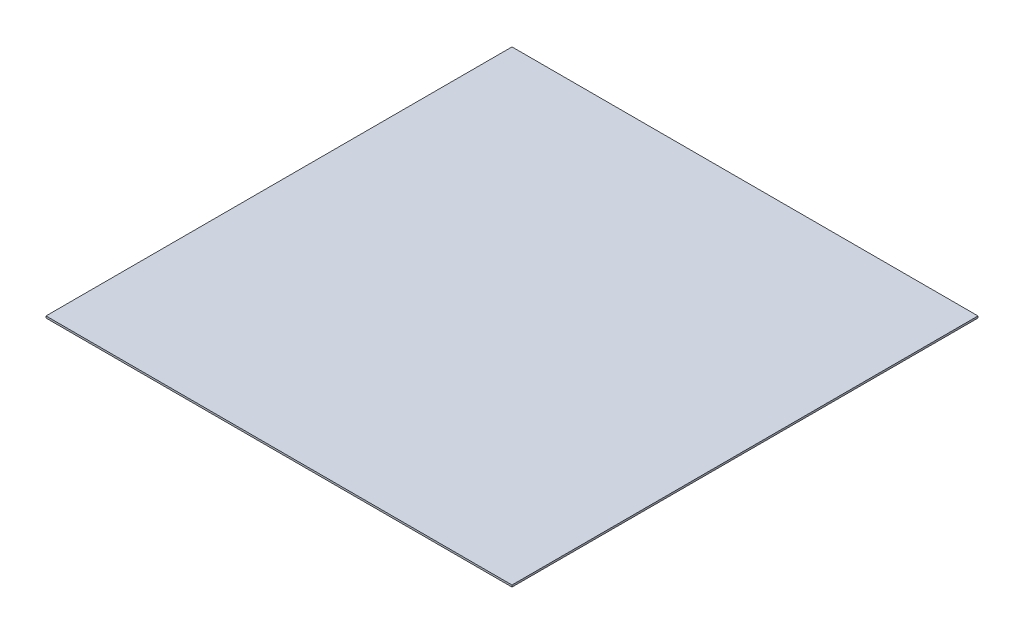
ISO-10303-21;
HEADER;
FILE_DESCRIPTION(('STEP AP214'),'2;1');
FILE_NAME('part.step','',(''),(''),'','','');
FILE_SCHEMA(('AUTOMOTIVE_DESIGN { 1 0 10303 214 1 1 1 1 }'));
ENDSEC;
DATA;
#1=APPLICATION_CONTEXT('core data for automotive mechanical design processes');
#2=APPLICATION_PROTOCOL_DEFINITION('international standard','automotive_design',2000,#1);
#3=PRODUCT_CONTEXT('',#1,'mechanical');
#4=PRODUCT('Part','Part','',(#3));
#5=PRODUCT_RELATED_PRODUCT_CATEGORY('part','',(#4));
#6=PRODUCT_DEFINITION_FORMATION('','',#4);
#7=PRODUCT_DEFINITION_CONTEXT('part definition',#1,'design');
#8=PRODUCT_DEFINITION('design','',#6,#7);
#9=PRODUCT_DEFINITION_SHAPE('','',#8);
#10=(LENGTH_UNIT() NAMED_UNIT(*) SI_UNIT(.MILLI.,.METRE.));
#11=(NAMED_UNIT(*) PLANE_ANGLE_UNIT() SI_UNIT($,.RADIAN.));
#12=(NAMED_UNIT(*) SI_UNIT($,.STERADIAN.) SOLID_ANGLE_UNIT());
#13=UNCERTAINTY_MEASURE_WITH_UNIT(LENGTH_MEASURE(1.E-05),#10,'distance_accuracy_value','');
#14=(GEOMETRIC_REPRESENTATION_CONTEXT(3) GLOBAL_UNCERTAINTY_ASSIGNED_CONTEXT((#13)) GLOBAL_UNIT_ASSIGNED_CONTEXT((#10,
#11,#12)) REPRESENTATION_CONTEXT('',''));
#15=CARTESIAN_POINT('',(0.,0.,0.));
#16=DIRECTION('',(0.,0.,1.));
#17=DIRECTION('',(1.,0.,0.));
#18=AXIS2_PLACEMENT_3D('',#15,#16,#17);
#19=CARTESIAN_POINT('',(103.,10.,-10.));
#20=DIRECTION('',(0.,0.,1.));
#21=DIRECTION('',(1.,0.,0.));
#22=AXIS2_PLACEMENT_3D('',#19,#20,#21);
#23=PLANE('',#22);
#24=CARTESIAN_POINT('',(0.,55.,-10.));
#25=DIRECTION('',(0.,0.,1.));
#26=DIRECTION('',(1.,0.,0.));
#27=AXIS2_PLACEMENT_3D('',#24,#25,#26);
#28=CIRCLE('',#27,15.);
#29=CARTESIAN_POINT('',(-14.1421356237309,60.,-10.));
#30=VERTEX_POINT('',#29);
#31=CARTESIAN_POINT('',(-13.467179647447,48.3943151495557,-10.));
#32=VERTEX_POINT('',#31);
#33=EDGE_CURVE('E11',#30,#32,#28,.T.);
#34=ORIENTED_EDGE('',*,*,#33,.F.);
#35=DIRECTION('',(-1.,0.,0.));
#36=VECTOR('',#35,1.);
#37=CARTESIAN_POINT('',(103.,60.,-10.));
#38=LINE('',#37,#36);
#39=CARTESIAN_POINT('',(-20.,60.,-10.));
#40=VERTEX_POINT('',#39);
#41=EDGE_CURVE('E264',#30,#40,#38,.T.);
#42=ORIENTED_EDGE('',*,*,#41,.T.);
#43=DIRECTION('',(-0.330350424728106,-0.943858356366018,0.));
#44=VECTOR('',#43,1.);
#45=CARTESIAN_POINT('',(-20.,60.,-10.));
#46=LINE('',#45,#44);
#47=CARTESIAN_POINT('',(-37.5,10.,-10.));
#48=VERTEX_POINT('',#47);
#49=EDGE_CURVE('E298',#40,#48,#46,.T.);
#50=ORIENTED_EDGE('',*,*,#49,.T.);
#51=DIRECTION('',(-1.,0.,0.));
#52=VECTOR('',#51,1.);
#53=CARTESIAN_POINT('',(103.,10.,-10.));
#54=LINE('',#53,#52);
#55=CARTESIAN_POINT('',(-26.9051899497914,10.,-10.));
#56=VERTEX_POINT('',#55);
#57=EDGE_CURVE('E267',#56,#48,#54,.T.);
#58=ORIENTED_EDGE('',*,*,#57,.F.);
#59=DIRECTION('',(0.330350424728106,0.943858356366017,0.));
#60=VECTOR('',#59,1.);
#61=CARTESIAN_POINT('',(-12.9051899497914,50.,-10.));
#62=LINE('',#61,#60);
#63=EDGE_CURVE('E287',#56,#32,#62,.T.);
#64=ORIENTED_EDGE('',*,*,#63,.T.);
#65=EDGE_LOOP('',(#34,#42,#50,#58,#64));
#66=FACE_BOUND('',#65,.T.);
#67=ADVANCED_FACE('F17',(#66),#23,.T.);
#68=CARTESIAN_POINT('',(103.,10.,10.));
#69=DIRECTION('',(0.,0.,-1.));
#70=DIRECTION('',(-1.,0.,0.));
#71=AXIS2_PLACEMENT_3D('',#68,#69,#70);
#72=PLANE('',#71);
#73=CARTESIAN_POINT('',(0.,55.,10.));
#74=DIRECTION('',(0.,0.,-1.));
#75=DIRECTION('',(-1.,0.,0.));
#76=AXIS2_PLACEMENT_3D('',#73,#74,#75);
#77=CIRCLE('',#76,15.);
#78=CARTESIAN_POINT('',(14.1421356237309,60.,10.));
#79=VERTEX_POINT('',#78);
#80=CARTESIAN_POINT('',(13.467179647447,48.3943151495557,10.));
#81=VERTEX_POINT('',#80);
#82=EDGE_CURVE('E205',#79,#81,#77,.T.);
#83=ORIENTED_EDGE('',*,*,#82,.F.);
#84=DIRECTION('',(-1.,0.,0.));
#85=VECTOR('',#84,1.);
#86=CARTESIAN_POINT('',(103.,60.,10.));
#87=LINE('',#86,#85);
#88=CARTESIAN_POINT('',(20.,60.,10.));
#89=VERTEX_POINT('',#88);
#90=EDGE_CURVE('E183',#89,#79,#87,.T.);
#91=ORIENTED_EDGE('',*,*,#90,.F.);
#92=DIRECTION('',(0.330350424728106,-0.943858356366018,0.));
#93=VECTOR('',#92,1.);
#94=CARTESIAN_POINT('',(20.,60.,10.));
#95=LINE('',#94,#93);
#96=CARTESIAN_POINT('',(37.5,10.,10.));
#97=VERTEX_POINT('',#96);
#98=EDGE_CURVE('E283',#89,#97,#95,.T.);
#99=ORIENTED_EDGE('',*,*,#98,.T.);
#100=DIRECTION('',(-1.,0.,0.));
#101=VECTOR('',#100,1.);
#102=CARTESIAN_POINT('',(103.,10.,10.));
#103=LINE('',#102,#101);
#104=CARTESIAN_POINT('',(26.9051899497914,10.,10.));
#105=VERTEX_POINT('',#104);
#106=EDGE_CURVE('E196',#97,#105,#103,.T.);
#107=ORIENTED_EDGE('',*,*,#106,.T.);
#108=DIRECTION('',(-0.330350424728106,0.943858356366018,0.));
#109=VECTOR('',#108,1.);
#110=CARTESIAN_POINT('',(12.9051899497914,50.,10.));
#111=LINE('',#110,#109);
#112=EDGE_CURVE('E280',#105,#81,#111,.T.);
#113=ORIENTED_EDGE('',*,*,#112,.T.);
#114=EDGE_LOOP('',(#83,#91,#99,#107,#113));
#115=FACE_BOUND('',#114,.T.);
#116=ADVANCED_FACE('F451',(#115),#72,.T.);
#117=CARTESIAN_POINT('',(0.,60.,0.));
#118=DIRECTION('',(0.,1.,0.));
#119=DIRECTION('',(0.,0.,1.));
#120=AXIS2_PLACEMENT_3D('',#117,#118,#119);
#121=PLANE('',#120);
#122=DIRECTION('',(0.,0.,-1.));
#123=VECTOR('',#122,1.);
#124=CARTESIAN_POINT('',(-20.,60.,0.));
#125=LINE('',#124,#123);
#126=CARTESIAN_POINT('',(-20.,60.,-20.));
#127=VERTEX_POINT('',#126);
#128=EDGE_CURVE('E376',#40,#127,#125,.T.);
#129=ORIENTED_EDGE('',*,*,#128,.F.);
#130=ORIENTED_EDGE('',*,*,#41,.F.);
#131=CARTESIAN_POINT('',(14.1421356237309,60.,-10.));
#132=VERTEX_POINT('',#131);
#133=EDGE_CURVE('E268',#132,#30,#38,.T.);
#134=ORIENTED_EDGE('',*,*,#133,.F.);
#135=CARTESIAN_POINT('',(20.,60.,-10.));
#136=VERTEX_POINT('',#135);
#137=EDGE_CURVE('E265',#136,#132,#38,.T.);
#138=ORIENTED_EDGE('',*,*,#137,.F.);
#139=DIRECTION('',(0.,0.,1.));
#140=VECTOR('',#139,1.);
#141=CARTESIAN_POINT('',(20.,60.,0.));
#142=LINE('',#141,#140);
#143=CARTESIAN_POINT('',(20.,60.,-20.));
#144=VERTEX_POINT('',#143);
#145=EDGE_CURVE('E380',#144,#136,#142,.T.);
#146=ORIENTED_EDGE('',*,*,#145,.F.);
#147=DIRECTION('',(-1.,0.,0.));
#148=VECTOR('',#147,1.);
#149=CARTESIAN_POINT('',(103.,60.,-20.));
#150=LINE('',#149,#148);
#151=EDGE_CURVE('E300',#144,#127,#150,.T.);
#152=ORIENTED_EDGE('',*,*,#151,.T.);
#153=EDGE_LOOP('',(#129,#130,#134,#138,#146,#152));
#154=FACE_BOUND('',#153,.T.);
#155=ADVANCED_FACE('F458',(#154),#121,.T.);
#156=CARTESIAN_POINT('',(20.,60.,20.));
#157=VERTEX_POINT('',#156);
#158=EDGE_CURVE('E379',#89,#157,#142,.T.);
#159=ORIENTED_EDGE('',*,*,#158,.F.);
#160=ORIENTED_EDGE('',*,*,#90,.T.);
#161=CARTESIAN_POINT('',(-14.1421356237309,60.,10.));
#162=VERTEX_POINT('',#161);
#163=EDGE_CURVE('E176',#79,#162,#87,.T.);
#164=ORIENTED_EDGE('',*,*,#163,.T.);
#165=CARTESIAN_POINT('',(-20.,60.,10.));
#166=VERTEX_POINT('',#165);
#167=EDGE_CURVE('E181',#162,#166,#87,.T.);
#168=ORIENTED_EDGE('',*,*,#167,.T.);
#169=CARTESIAN_POINT('',(-20.,60.,20.));
#170=VERTEX_POINT('',#169);
#171=EDGE_CURVE('E377',#170,#166,#125,.T.);
#172=ORIENTED_EDGE('',*,*,#171,.F.);
#173=DIRECTION('',(-1.,0.,0.));
#174=VECTOR('',#173,1.);
#175=CARTESIAN_POINT('',(103.,60.,20.));
#176=LINE('',#175,#174);
#177=EDGE_CURVE('E303',#157,#170,#176,.T.);
#178=ORIENTED_EDGE('',*,*,#177,.F.);
#179=EDGE_LOOP('',(#159,#160,#164,#168,#172,#178));
#180=FACE_BOUND('',#179,.T.);
#181=ADVANCED_FACE('F179',(#180),#121,.T.);
#182=CARTESIAN_POINT('',(-20.,60.,-65.5));
#183=DIRECTION('',(0.943858356366017,-0.330350424728106,0.));
#184=DIRECTION('',(0.330350424728106,0.943858356366018,0.));
#185=AXIS2_PLACEMENT_3D('',#182,#183,#184);
#186=PLANE('',#185);
#187=ORIENTED_EDGE('',*,*,#49,.F.);
#188=ORIENTED_EDGE('',*,*,#128,.T.);
#189=DIRECTION('',(0.313677500463754,0.896221429896442,0.313677500463755));
#190=VECTOR('',#189,1.);
#191=CARTESIAN_POINT('',(-24.4769076305221,47.2088353413655,-24.4769076305221));
#192=LINE('',#191,#190);
#193=CARTESIAN_POINT('',(-37.5,10.,-37.5));
#194=VERTEX_POINT('',#193);
#195=EDGE_CURVE('E312',#194,#127,#192,.T.);
#196=ORIENTED_EDGE('',*,*,#195,.F.);
#197=DIRECTION('',(0.,0.,1.));
#198=VECTOR('',#197,1.);
#199=CARTESIAN_POINT('',(-37.5,10.,37.5));
#200=LINE('',#199,#198);
#201=EDGE_CURVE('E344',#194,#48,#200,.T.);
#202=ORIENTED_EDGE('',*,*,#201,.T.);
#203=EDGE_LOOP('',(#187,#188,#196,#202));
#204=FACE_BOUND('',#203,.T.);
#205=ADVANCED_FACE('F498',(#204),#186,.F.);
#206=DIRECTION('',(0.330350424728106,0.943858356366018,0.));
#207=VECTOR('',#206,1.);
#208=CARTESIAN_POINT('',(-20.,60.,10.));
#209=LINE('',#208,#207);
#210=CARTESIAN_POINT('',(-37.5,10.,10.));
#211=VERTEX_POINT('',#210);
#212=EDGE_CURVE('E194',#211,#166,#209,.T.);
#213=ORIENTED_EDGE('',*,*,#212,.F.);
#214=CARTESIAN_POINT('',(-37.5,10.,37.5));
#215=VERTEX_POINT('',#214);
#216=EDGE_CURVE('E331',#211,#215,#200,.T.);
#217=ORIENTED_EDGE('',*,*,#216,.T.);
#218=DIRECTION('',(-0.313677500463754,-0.896221429896442,0.313677500463754));
#219=VECTOR('',#218,1.);
#220=CARTESIAN_POINT('',(-11.5873493975904,84.0361445783133,11.5873493975904));
#221=LINE('',#220,#219);
#222=EDGE_CURVE('E324',#170,#215,#221,.T.);
#223=ORIENTED_EDGE('',*,*,#222,.F.);
#224=ORIENTED_EDGE('',*,*,#171,.T.);
#225=EDGE_LOOP('',(#213,#217,#223,#224));
#226=FACE_BOUND('',#225,.T.);
#227=ADVANCED_FACE('F496',(#226),#186,.F.);
#228=CARTESIAN_POINT('',(20.,60.,-65.5));
#229=DIRECTION('',(-0.943858356366017,-0.330350424728106,0.));
#230=DIRECTION('',(0.330350424728106,-0.943858356366018,0.));
#231=AXIS2_PLACEMENT_3D('',#228,#229,#230);
#232=PLANE('',#231);
#233=DIRECTION('',(-0.330350424728106,0.943858356366018,0.));
#234=VECTOR('',#233,1.);
#235=CARTESIAN_POINT('',(20.,60.,-10.));
#236=LINE('',#235,#234);
#237=CARTESIAN_POINT('',(37.5,10.,-10.));
#238=VERTEX_POINT('',#237);
#239=EDGE_CURVE('E296',#238,#136,#236,.T.);
#240=ORIENTED_EDGE('',*,*,#239,.F.);
#241=DIRECTION('',(0.,0.,-1.));
#242=VECTOR('',#241,1.);
#243=CARTESIAN_POINT('',(37.5,10.,37.5));
#244=LINE('',#243,#242);
#245=CARTESIAN_POINT('',(37.5,10.,-37.5));
#246=VERTEX_POINT('',#245);
#247=EDGE_CURVE('E351',#238,#246,#244,.T.);
#248=ORIENTED_EDGE('',*,*,#247,.T.);
#249=DIRECTION('',(0.313677500463754,-0.896221429896442,-0.313677500463755));
#250=VECTOR('',#249,1.);
#251=CARTESIAN_POINT('',(24.4769076305221,47.2088353413655,-24.4769076305221));
#252=LINE('',#251,#250);
#253=EDGE_CURVE('E309',#144,#246,#252,.T.);
#254=ORIENTED_EDGE('',*,*,#253,.F.);
#255=ORIENTED_EDGE('',*,*,#145,.T.);
#256=EDGE_LOOP('',(#240,#248,#254,#255));
#257=FACE_BOUND('',#256,.T.);
#258=ADVANCED_FACE('F493',(#257),#232,.F.);
#259=ORIENTED_EDGE('',*,*,#98,.F.);
#260=ORIENTED_EDGE('',*,*,#158,.T.);
#261=DIRECTION('',(-0.313677500463754,0.896221429896442,-0.313677500463754));
#262=VECTOR('',#261,1.);
#263=CARTESIAN_POINT('',(11.5873493975904,84.0361445783133,11.5873493975904));
#264=LINE('',#263,#262);
#265=CARTESIAN_POINT('',(37.5,10.,37.5));
#266=VERTEX_POINT('',#265);
#267=EDGE_CURVE('E321',#266,#157,#264,.T.);
#268=ORIENTED_EDGE('',*,*,#267,.F.);
#269=EDGE_CURVE('E352',#266,#97,#244,.T.);
#270=ORIENTED_EDGE('',*,*,#269,.T.);
#271=EDGE_LOOP('',(#259,#260,#268,#270));
#272=FACE_BOUND('',#271,.T.);
#273=ADVANCED_FACE('F491',(#272),#232,.F.);
#274=CARTESIAN_POINT('',(12.9051899497914,50.,-65.5));
#275=DIRECTION('',(0.,1.,0.));
#276=DIRECTION('',(0.,0.,1.));
#277=AXIS2_PLACEMENT_3D('',#274,#275,#276);
#278=PLANE('',#277);
#279=DIRECTION('',(1.,0.,0.));
#280=VECTOR('',#279,1.);
#281=CARTESIAN_POINT('',(12.9051899497914,50.,-10.));
#282=LINE('',#281,#280);
#283=CARTESIAN_POINT('',(-12.9051899497914,50.,-10.));
#284=VERTEX_POINT('',#283);
#285=CARTESIAN_POINT('',(12.9051899497914,50.,-10.));
#286=VERTEX_POINT('',#285);
#287=EDGE_CURVE('E289',#284,#286,#282,.T.);
#288=ORIENTED_EDGE('',*,*,#287,.F.);
#289=DIRECTION('',(0.,0.,1.));
#290=VECTOR('',#289,1.);
#291=CARTESIAN_POINT('',(-12.9051899497914,50.,-65.5));
#292=LINE('',#291,#290);
#293=CARTESIAN_POINT('',(-12.9051899497914,50.,-23.5));
#294=VERTEX_POINT('',#293);
#295=EDGE_CURVE('E341',#294,#284,#292,.T.);
#296=ORIENTED_EDGE('',*,*,#295,.F.);
#297=DIRECTION('',(-1.,0.,0.));
#298=VECTOR('',#297,1.);
#299=CARTESIAN_POINT('',(12.9051899497914,50.,-23.5));
#300=LINE('',#299,#298);
#301=CARTESIAN_POINT('',(12.9051899497914,50.,-23.5));
#302=VERTEX_POINT('',#301);
#303=EDGE_CURVE('E305',#302,#294,#300,.T.);
#304=ORIENTED_EDGE('',*,*,#303,.F.);
#305=DIRECTION('',(0.,0.,1.));
#306=VECTOR('',#305,1.);
#307=CARTESIAN_POINT('',(12.9051899497914,50.,-65.5));
#308=LINE('',#307,#306);
#309=EDGE_CURVE('E328',#302,#286,#308,.T.);
#310=ORIENTED_EDGE('',*,*,#309,.T.);
#311=EDGE_LOOP('',(#288,#296,#304,#310));
#312=FACE_BOUND('',#311,.T.);
#313=ADVANCED_FACE('F488',(#312),#278,.F.);
#314=DIRECTION('',(-1.,0.,0.));
#315=VECTOR('',#314,1.);
#316=CARTESIAN_POINT('',(12.9051899497914,50.,10.));
#317=LINE('',#316,#315);
#318=CARTESIAN_POINT('',(12.9051899497914,50.,10.));
#319=VERTEX_POINT('',#318);
#320=CARTESIAN_POINT('',(-12.9051899497914,50.,10.));
#321=VERTEX_POINT('',#320);
#322=EDGE_CURVE('E275',#319,#321,#317,.T.);
#323=ORIENTED_EDGE('',*,*,#322,.F.);
#324=CARTESIAN_POINT('',(12.9051899497914,50.,23.5));
#325=VERTEX_POINT('',#324);
#326=EDGE_CURVE('E332',#319,#325,#308,.T.);
#327=ORIENTED_EDGE('',*,*,#326,.T.);
#328=DIRECTION('',(1.,0.,0.));
#329=VECTOR('',#328,1.);
#330=CARTESIAN_POINT('',(12.9051899497914,50.,23.5));
#331=LINE('',#330,#329);
#332=CARTESIAN_POINT('',(-12.9051899497914,50.,23.5));
#333=VERTEX_POINT('',#332);
#334=EDGE_CURVE('E315',#333,#325,#331,.T.);
#335=ORIENTED_EDGE('',*,*,#334,.F.);
#336=EDGE_CURVE('E327',#321,#333,#292,.T.);
#337=ORIENTED_EDGE('',*,*,#336,.F.);
#338=EDGE_LOOP('',(#323,#327,#335,#337));
#339=FACE_BOUND('',#338,.T.);
#340=ADVANCED_FACE('F482',(#339),#278,.F.);
#341=CARTESIAN_POINT('',(12.9051899497914,50.,-65.5));
#342=DIRECTION('',(0.943858356366017,0.330350424728106,0.));
#343=DIRECTION('',(-0.330350424728106,0.943858356366018,0.));
#344=AXIS2_PLACEMENT_3D('',#341,#342,#343);
#345=PLANE('',#344);
#346=DIRECTION('',(0.330350424728106,-0.943858356366018,0.));
#347=VECTOR('',#346,1.);
#348=CARTESIAN_POINT('',(12.9051899497914,50.,-10.));
#349=LINE('',#348,#347);
#350=CARTESIAN_POINT('',(13.467179647447,48.3943151495557,-10.));
#351=VERTEX_POINT('',#350);
#352=EDGE_CURVE('E293',#286,#351,#349,.T.);
#353=ORIENTED_EDGE('',*,*,#352,.F.);
#354=ORIENTED_EDGE('',*,*,#309,.F.);
#355=DIRECTION('',(-0.313677500463754,0.896221429896442,0.313677500463755));
#356=VECTOR('',#355,1.);
#357=CARTESIAN_POINT('',(17.0377200702734,38.1927710843374,-27.6325301204819));
#358=LINE('',#357,#356);
#359=CARTESIAN_POINT('',(26.9051899497914,10.,-37.5));
#360=VERTEX_POINT('',#359);
#361=EDGE_CURVE('E307',#360,#302,#358,.T.);
#362=ORIENTED_EDGE('',*,*,#361,.F.);
#363=DIRECTION('',(0.,0.,1.));
#364=VECTOR('',#363,1.);
#365=CARTESIAN_POINT('',(26.9051899497914,10.,-65.5));
#366=LINE('',#365,#364);
#367=CARTESIAN_POINT('',(26.9051899497914,10.,-10.));
#368=VERTEX_POINT('',#367);
#369=EDGE_CURVE('E333',#360,#368,#366,.T.);
#370=ORIENTED_EDGE('',*,*,#369,.T.);
#371=EDGE_CURVE('E292',#351,#368,#349,.T.);
#372=ORIENTED_EDGE('',*,*,#371,.F.);
#373=EDGE_LOOP('',(#353,#354,#362,#370,#372));
#374=FACE_BOUND('',#373,.T.);
#375=ADVANCED_FACE('F478',(#374),#345,.F.);
#376=ORIENTED_EDGE('',*,*,#112,.F.);
#377=CARTESIAN_POINT('',(26.9051899497915,10.,37.5));
#378=VERTEX_POINT('',#377);
#379=EDGE_CURVE('E336',#105,#378,#366,.T.);
#380=ORIENTED_EDGE('',*,*,#379,.T.);
#381=DIRECTION('',(0.313677500463754,-0.896221429896442,0.313677500463754));
#382=VECTOR('',#381,1.);
#383=CARTESIAN_POINT('',(4.14816183734165,75.0200803212851,14.7429718875502));
#384=LINE('',#383,#382);
#385=EDGE_CURVE('E318',#325,#378,#384,.T.);
#386=ORIENTED_EDGE('',*,*,#385,.F.);
#387=ORIENTED_EDGE('',*,*,#326,.F.);
#388=EDGE_CURVE('E279',#81,#319,#111,.T.);
#389=ORIENTED_EDGE('',*,*,#388,.F.);
#390=EDGE_LOOP('',(#376,#380,#386,#387,#389));
#391=FACE_BOUND('',#390,.T.);
#392=ADVANCED_FACE('F481',(#391),#345,.F.);
#393=CARTESIAN_POINT('',(-12.9051899497914,50.,-65.5));
#394=DIRECTION('',(-0.943858356366017,0.330350424728106,0.));
#395=DIRECTION('',(-0.330350424728106,-0.943858356366017,0.));
#396=AXIS2_PLACEMENT_3D('',#393,#394,#395);
#397=PLANE('',#396);
#398=ORIENTED_EDGE('',*,*,#63,.F.);
#399=DIRECTION('',(0.,0.,1.));
#400=VECTOR('',#399,1.);
#401=CARTESIAN_POINT('',(-26.9051899497914,10.,-65.5));
#402=LINE('',#401,#400);
#403=CARTESIAN_POINT('',(-26.9051899497914,10.,-37.5));
#404=VERTEX_POINT('',#403);
#405=EDGE_CURVE('E337',#404,#56,#402,.T.);
#406=ORIENTED_EDGE('',*,*,#405,.F.);
#407=DIRECTION('',(-0.313677500463755,-0.896221429896442,-0.313677500463755));
#408=VECTOR('',#407,1.);
#409=CARTESIAN_POINT('',(-17.0377200702734,38.1927710843374,-27.6325301204819));
#410=LINE('',#409,#408);
#411=EDGE_CURVE('E383',#294,#404,#410,.T.);
#412=ORIENTED_EDGE('',*,*,#411,.F.);
#413=ORIENTED_EDGE('',*,*,#295,.T.);
#414=EDGE_CURVE('E286',#32,#284,#62,.T.);
#415=ORIENTED_EDGE('',*,*,#414,.F.);
#416=EDGE_LOOP('',(#398,#406,#412,#413,#415));
#417=FACE_BOUND('',#416,.T.);
#418=ADVANCED_FACE('F484',(#417),#397,.F.);
#419=DIRECTION('',(-0.330350424728106,-0.943858356366017,0.));
#420=VECTOR('',#419,1.);
#421=CARTESIAN_POINT('',(-12.9051899497914,50.,10.));
#422=LINE('',#421,#420);
#423=CARTESIAN_POINT('',(-13.467179647447,48.3943151495557,10.));
#424=VERTEX_POINT('',#423);
#425=EDGE_CURVE('E272',#321,#424,#422,.T.);
#426=ORIENTED_EDGE('',*,*,#425,.F.);
#427=ORIENTED_EDGE('',*,*,#336,.T.);
#428=DIRECTION('',(0.313677500463755,0.896221429896442,-0.313677500463754));
#429=VECTOR('',#428,1.);
#430=CARTESIAN_POINT('',(-4.14816183734164,75.0200803212851,14.7429718875502));
#431=LINE('',#430,#429);
#432=CARTESIAN_POINT('',(-26.9051899497914,10.,37.5));
#433=VERTEX_POINT('',#432);
#434=EDGE_CURVE('E385',#433,#333,#431,.T.);
#435=ORIENTED_EDGE('',*,*,#434,.F.);
#436=CARTESIAN_POINT('',(-26.9051899497914,10.,10.));
#437=VERTEX_POINT('',#436);
#438=EDGE_CURVE('E340',#437,#433,#402,.T.);
#439=ORIENTED_EDGE('',*,*,#438,.F.);
#440=EDGE_CURVE('E276',#424,#437,#422,.T.);
#441=ORIENTED_EDGE('',*,*,#440,.F.);
#442=EDGE_LOOP('',(#426,#427,#435,#439,#441));
#443=FACE_BOUND('',#442,.T.);
#444=ADVANCED_FACE('F430',(#443),#397,.F.);
#445=CARTESIAN_POINT('',(0.,10.,0.));
#446=DIRECTION('',(0.,-1.,0.));
#447=DIRECTION('',(0.,0.,-1.));
#448=AXIS2_PLACEMENT_3D('',#445,#446,#447);
#449=CYLINDRICAL_SURFACE('',#448,75.);
#450=CARTESIAN_POINT('',(0.,10.,0.));
#451=DIRECTION('',(0.,1.,0.));
#452=DIRECTION('',(0.,0.,1.));
#453=AXIS2_PLACEMENT_3D('',#450,#451,#452);
#454=CIRCLE('',#453,75.);
#455=CARTESIAN_POINT('',(0.,10.,75.));
#456=VERTEX_POINT('',#455);
#457=EDGE_CURVE('E368',#456,#456,#454,.T.);
#458=ORIENTED_EDGE('',*,*,#457,.F.);
#459=EDGE_LOOP('',(#458));
#460=FACE_BOUND('',#459,.T.);
#461=CARTESIAN_POINT('',(0.,0.,0.));
#462=DIRECTION('',(0.,1.,0.));
#463=DIRECTION('',(0.,0.,1.));
#464=AXIS2_PLACEMENT_3D('',#461,#462,#463);
#465=CIRCLE('',#464,75.);
#466=CARTESIAN_POINT('',(0.,0.,75.));
#467=VERTEX_POINT('',#466);
#468=EDGE_CURVE('E367',#467,#467,#465,.T.);
#469=ORIENTED_EDGE('',*,*,#468,.T.);
#470=EDGE_LOOP('',(#469));
#471=FACE_BOUND('',#470,.T.);
#472=ADVANCED_FACE('F19',(#460,#471),#449,.T.);
#473=CARTESIAN_POINT('',(0.,10.,0.));
#474=DIRECTION('',(0.,1.,0.));
#475=DIRECTION('',(0.,0.,1.));
#476=AXIS2_PLACEMENT_3D('',#473,#474,#475);
#477=PLANE('',#476);
#478=CARTESIAN_POINT('',(29.9999999999995,10.,51.9615242270666));
#479=DIRECTION('',(0.,1.,0.));
#480=DIRECTION('',(0.,0.,1.));
#481=AXIS2_PLACEMENT_3D('',#478,#479,#480);
#482=CIRCLE('',#481,5.);
#483=CARTESIAN_POINT('',(29.9999999999995,10.,56.9615242270666));
#484=VERTEX_POINT('',#483);
#485=EDGE_CURVE('E206',#484,#484,#482,.T.);
#486=ORIENTED_EDGE('',*,*,#485,.F.);
#487=EDGE_LOOP('',(#486));
#488=FACE_BOUND('',#487,.T.);
#489=CARTESIAN_POINT('',(30.,10.,-51.9615242270662));
#490=DIRECTION('',(0.,1.,0.));
#491=DIRECTION('',(0.,0.,1.));
#492=AXIS2_PLACEMENT_3D('',#489,#490,#491);
#493=CIRCLE('',#492,5.);
#494=CARTESIAN_POINT('',(30.,10.,-46.9615242270662));
#495=VERTEX_POINT('',#494);
#496=EDGE_CURVE('E393',#495,#495,#493,.T.);
#497=ORIENTED_EDGE('',*,*,#496,.F.);
#498=EDGE_LOOP('',(#497));
#499=FACE_BOUND('',#498,.T.);
#500=CARTESIAN_POINT('',(-60.,10.,0.));
#501=DIRECTION('',(0.,1.,0.));
#502=DIRECTION('',(0.,0.,1.));
#503=AXIS2_PLACEMENT_3D('',#500,#501,#502);
#504=CIRCLE('',#503,5.);
#505=CARTESIAN_POINT('',(-60.,10.,5.00000000000001));
#506=VERTEX_POINT('',#505);
#507=EDGE_CURVE('E388',#506,#506,#504,.T.);
#508=ORIENTED_EDGE('',*,*,#507,.F.);
#509=EDGE_LOOP('',(#508));
#510=FACE_BOUND('',#509,.T.);
#511=CARTESIAN_POINT('',(0.,10.,0.));
#512=DIRECTION('',(0.,1.,0.));
#513=DIRECTION('',(0.,0.,1.));
#514=AXIS2_PLACEMENT_3D('',#511,#512,#513);
#515=CIRCLE('',#514,5.);
#516=CARTESIAN_POINT('',(0.,10.,5.));
#517=VERTEX_POINT('',#516);
#518=EDGE_CURVE('E258',#517,#517,#515,.T.);
#519=ORIENTED_EDGE('',*,*,#518,.F.);
#520=EDGE_LOOP('',(#519));
#521=FACE_BOUND('',#520,.T.);
#522=ORIENTED_EDGE('',*,*,#216,.F.);
#523=EDGE_CURVE('E262',#437,#211,#103,.T.);
#524=ORIENTED_EDGE('',*,*,#523,.F.);
#525=ORIENTED_EDGE('',*,*,#438,.T.);
#526=DIRECTION('',(1.,0.,0.));
#527=VECTOR('',#526,1.);
#528=CARTESIAN_POINT('',(37.5,10.,37.5));
#529=LINE('',#528,#527);
#530=EDGE_CURVE('E348',#215,#433,#529,.T.);
#531=ORIENTED_EDGE('',*,*,#530,.F.);
#532=EDGE_LOOP('',(#522,#524,#525,#531));
#533=FACE_BOUND('',#532,.T.);
#534=ORIENTED_EDGE('',*,*,#247,.F.);
#535=EDGE_CURVE('E271',#238,#368,#54,.T.);
#536=ORIENTED_EDGE('',*,*,#535,.T.);
#537=ORIENTED_EDGE('',*,*,#369,.F.);
#538=DIRECTION('',(-1.,0.,0.));
#539=VECTOR('',#538,1.);
#540=CARTESIAN_POINT('',(37.5,10.,-37.5));
#541=LINE('',#540,#539);
#542=EDGE_CURVE('E356',#246,#360,#541,.T.);
#543=ORIENTED_EDGE('',*,*,#542,.F.);
#544=EDGE_LOOP('',(#534,#536,#537,#543));
#545=FACE_BOUND('',#544,.T.);
#546=ORIENTED_EDGE('',*,*,#57,.T.);
#547=ORIENTED_EDGE('',*,*,#201,.F.);
#548=EDGE_CURVE('E355',#404,#194,#541,.T.);
#549=ORIENTED_EDGE('',*,*,#548,.F.);
#550=ORIENTED_EDGE('',*,*,#405,.T.);
#551=EDGE_LOOP('',(#546,#547,#549,#550));
#552=FACE_BOUND('',#551,.T.);
#553=ORIENTED_EDGE('',*,*,#379,.F.);
#554=ORIENTED_EDGE('',*,*,#106,.F.);
#555=ORIENTED_EDGE('',*,*,#269,.F.);
#556=EDGE_CURVE('E347',#378,#266,#529,.T.);
#557=ORIENTED_EDGE('',*,*,#556,.F.);
#558=EDGE_LOOP('',(#553,#554,#555,#557));
#559=FACE_BOUND('',#558,.T.);
#560=ORIENTED_EDGE('',*,*,#457,.T.);
#561=EDGE_LOOP('',(#560));
#562=FACE_BOUND('',#561,.T.);
#563=ADVANCED_FACE('F401',(#488,#499,#510,#521,#533,#545,#552,#559,#562),#477,.T.);
#564=CARTESIAN_POINT('',(0.,0.,0.));
#565=DIRECTION('',(0.,1.,0.));
#566=DIRECTION('',(0.,0.,1.));
#567=AXIS2_PLACEMENT_3D('',#564,#565,#566);
#568=PLANE('',#567);
#569=CARTESIAN_POINT('',(0.,0.,0.));
#570=DIRECTION('',(0.,1.,0.));
#571=DIRECTION('',(0.,0.,1.));
#572=AXIS2_PLACEMENT_3D('',#569,#570,#571);
#573=CIRCLE('',#572,45.);
#574=CARTESIAN_POINT('',(0.,0.,45.));
#575=VERTEX_POINT('',#574);
#576=EDGE_CURVE('E371',#575,#575,#573,.F.);
#577=ORIENTED_EDGE('',*,*,#576,.F.);
#578=EDGE_LOOP('',(#577));
#579=FACE_BOUND('',#578,.T.);
#580=ORIENTED_EDGE('',*,*,#468,.F.);
#581=EDGE_LOOP('',(#580));
#582=FACE_BOUND('',#581,.T.);
#583=ADVANCED_FACE('F404',(#579,#582),#568,.F.);
#584=CARTESIAN_POINT('',(0.,-50.,0.));
#585=DIRECTION('',(0.,-1.,0.));
#586=DIRECTION('',(0.,0.,-1.));
#587=AXIS2_PLACEMENT_3D('',#584,#585,#586);
#588=PLANE('',#587);
#589=CARTESIAN_POINT('',(0.,-50.,0.));
#590=DIRECTION('',(0.,-1.,0.));
#591=DIRECTION('',(0.,0.,-1.));
#592=AXIS2_PLACEMENT_3D('',#589,#590,#591);
#593=CIRCLE('',#592,45.);
#594=CARTESIAN_POINT('',(0.,-50.,-45.));
#595=VERTEX_POINT('',#594);
#596=EDGE_CURVE('E362',#595,#595,#593,.T.);
#597=ORIENTED_EDGE('',*,*,#596,.T.);
#598=EDGE_LOOP('',(#597));
#599=FACE_BOUND('',#598,.T.);
#600=CARTESIAN_POINT('',(0.,-50.,0.));
#601=DIRECTION('',(0.,-1.,0.));
#602=DIRECTION('',(0.,0.,-1.));
#603=AXIS2_PLACEMENT_3D('',#600,#601,#602);
#604=CIRCLE('',#603,40.);
#605=CARTESIAN_POINT('',(0.,-50.,-40.));
#606=VERTEX_POINT('',#605);
#607=EDGE_CURVE('E359',#606,#606,#604,.T.);
#608=ORIENTED_EDGE('',*,*,#607,.F.);
#609=EDGE_LOOP('',(#608));
#610=FACE_BOUND('',#609,.T.);
#611=ADVANCED_FACE('F434',(#599,#610),#588,.T.);
#612=CARTESIAN_POINT('',(0.,-50.,0.));
#613=DIRECTION('',(0.,1.,0.));
#614=DIRECTION('',(0.,0.,1.));
#615=AXIS2_PLACEMENT_3D('',#612,#613,#614);
#616=CYLINDRICAL_SURFACE('',#615,45.);
#617=ORIENTED_EDGE('',*,*,#596,.F.);
#618=EDGE_LOOP('',(#617));
#619=FACE_BOUND('',#618,.T.);
#620=ORIENTED_EDGE('',*,*,#576,.T.);
#621=EDGE_LOOP('',(#620));
#622=FACE_BOUND('',#621,.T.);
#623=ADVANCED_FACE('F442',(#619,#622),#616,.T.);
#624=CARTESIAN_POINT('',(0.,-50.,0.));
#625=DIRECTION('',(0.,1.,0.));
#626=DIRECTION('',(0.,0.,1.));
#627=AXIS2_PLACEMENT_3D('',#624,#625,#626);
#628=CYLINDRICAL_SURFACE('',#627,40.);
#629=ORIENTED_EDGE('',*,*,#607,.T.);
#630=EDGE_LOOP('',(#629));
#631=FACE_BOUND('',#630,.T.);
#632=CARTESIAN_POINT('',(0.,0.,0.));
#633=DIRECTION('',(0.,-1.,0.));
#634=DIRECTION('',(0.,0.,-1.));
#635=AXIS2_PLACEMENT_3D('',#632,#633,#634);
#636=CIRCLE('',#635,40.);
#637=CARTESIAN_POINT('',(0.,0.,-40.));
#638=VERTEX_POINT('',#637);
#639=EDGE_CURVE('E358',#638,#638,#636,.T.);
#640=ORIENTED_EDGE('',*,*,#639,.F.);
#641=EDGE_LOOP('',(#640));
#642=FACE_BOUND('',#641,.T.);
#643=ADVANCED_FACE('F448',(#631,#642),#628,.F.);
#644=CARTESIAN_POINT('',(0.,0.,0.));
#645=DIRECTION('',(0.,1.,0.));
#646=DIRECTION('',(0.,0.,1.));
#647=AXIS2_PLACEMENT_3D('',#644,#645,#646);
#648=CIRCLE('',#647,5.);
#649=CARTESIAN_POINT('',(0.,0.,5.));
#650=VERTEX_POINT('',#649);
#651=EDGE_CURVE('E261',#650,#650,#648,.T.);
#652=ORIENTED_EDGE('',*,*,#651,.T.);
#653=EDGE_LOOP('',(#652));
#654=FACE_BOUND('',#653,.T.);
#655=ORIENTED_EDGE('',*,*,#639,.T.);
#656=EDGE_LOOP('',(#655));
#657=FACE_BOUND('',#656,.T.);
#658=ADVANCED_FACE('F436',(#654,#657),#568,.F.);
#659=CARTESIAN_POINT('',(103.,60.,-20.));
#660=DIRECTION('',(0.,0.330350424728106,-0.943858356366017));
#661=DIRECTION('',(0.,0.943858356366017,0.330350424728106));
#662=AXIS2_PLACEMENT_3D('',#659,#660,#661);
#663=PLANE('',#662);
#664=ORIENTED_EDGE('',*,*,#195,.T.);
#665=ORIENTED_EDGE('',*,*,#151,.F.);
#666=ORIENTED_EDGE('',*,*,#253,.T.);
#667=ORIENTED_EDGE('',*,*,#542,.T.);
#668=ORIENTED_EDGE('',*,*,#361,.T.);
#669=ORIENTED_EDGE('',*,*,#303,.T.);
#670=ORIENTED_EDGE('',*,*,#411,.T.);
#671=ORIENTED_EDGE('',*,*,#548,.T.);
#672=EDGE_LOOP('',(#664,#665,#666,#667,#668,#669,#670,#671));
#673=FACE_BOUND('',#672,.T.);
#674=ADVANCED_FACE('F447',(#673),#663,.T.);
#675=CARTESIAN_POINT('',(103.,60.,20.));
#676=DIRECTION('',(0.,0.330350424728106,0.943858356366017));
#677=DIRECTION('',(0.,-0.943858356366018,0.330350424728106));
#678=AXIS2_PLACEMENT_3D('',#675,#676,#677);
#679=PLANE('',#678);
#680=ORIENTED_EDGE('',*,*,#222,.T.);
#681=ORIENTED_EDGE('',*,*,#530,.T.);
#682=ORIENTED_EDGE('',*,*,#434,.T.);
#683=ORIENTED_EDGE('',*,*,#334,.T.);
#684=ORIENTED_EDGE('',*,*,#385,.T.);
#685=ORIENTED_EDGE('',*,*,#556,.T.);
#686=ORIENTED_EDGE('',*,*,#267,.T.);
#687=ORIENTED_EDGE('',*,*,#177,.T.);
#688=EDGE_LOOP('',(#680,#681,#682,#683,#684,#685,#686,#687));
#689=FACE_BOUND('',#688,.T.);
#690=ADVANCED_FACE('F463',(#689),#679,.T.);
#691=EDGE_CURVE('E21',#351,#132,#28,.T.);
#692=ORIENTED_EDGE('',*,*,#691,.F.);
#693=ORIENTED_EDGE('',*,*,#371,.T.);
#694=ORIENTED_EDGE('',*,*,#535,.F.);
#695=ORIENTED_EDGE('',*,*,#239,.T.);
#696=ORIENTED_EDGE('',*,*,#137,.T.);
#697=EDGE_LOOP('',(#692,#693,#694,#695,#696));
#698=FACE_BOUND('',#697,.T.);
#699=ADVANCED_FACE('F453',(#698),#23,.T.);
#700=EDGE_CURVE('E191',#424,#162,#77,.T.);
#701=ORIENTED_EDGE('',*,*,#700,.F.);
#702=ORIENTED_EDGE('',*,*,#440,.T.);
#703=ORIENTED_EDGE('',*,*,#523,.T.);
#704=ORIENTED_EDGE('',*,*,#212,.T.);
#705=ORIENTED_EDGE('',*,*,#167,.F.);
#706=EDGE_LOOP('',(#701,#702,#703,#704,#705));
#707=FACE_BOUND('',#706,.T.);
#708=ADVANCED_FACE('F190',(#707),#72,.T.);
#709=CARTESIAN_POINT('',(0.,-93.,0.));
#710=DIRECTION('',(0.,1.,0.));
#711=DIRECTION('',(0.,0.,1.));
#712=AXIS2_PLACEMENT_3D('',#709,#710,#711);
#713=CYLINDRICAL_SURFACE('',#712,5.);
#714=ORIENTED_EDGE('',*,*,#518,.T.);
#715=EDGE_LOOP('',(#714));
#716=FACE_BOUND('',#715,.T.);
#717=ORIENTED_EDGE('',*,*,#651,.F.);
#718=EDGE_LOOP('',(#717));
#719=FACE_BOUND('',#718,.T.);
#720=ADVANCED_FACE('F469',(#716,#719),#713,.F.);
#721=CARTESIAN_POINT('',(-60.,10.,0.));
#722=DIRECTION('',(0.,1.,0.));
#723=DIRECTION('',(0.,0.,1.));
#724=AXIS2_PLACEMENT_3D('',#721,#722,#723);
#725=CYLINDRICAL_SURFACE('',#724,5.);
#726=CARTESIAN_POINT('',(-60.,210.,0.));
#727=DIRECTION('',(0.,1.,0.));
#728=DIRECTION('',(0.,0.,1.));
#729=AXIS2_PLACEMENT_3D('',#726,#727,#728);
#730=CIRCLE('',#729,5.);
#731=CARTESIAN_POINT('',(-60.,210.,5.00000000000001));
#732=VERTEX_POINT('',#731);
#733=EDGE_CURVE('E255',#732,#732,#730,.T.);
#734=ORIENTED_EDGE('',*,*,#733,.F.);
#735=EDGE_LOOP('',(#734));
#736=FACE_BOUND('',#735,.T.);
#737=ORIENTED_EDGE('',*,*,#507,.T.);
#738=EDGE_LOOP('',(#737));
#739=FACE_BOUND('',#738,.T.);
#740=ADVANCED_FACE('F565',(#736,#739),#725,.T.);
#741=CARTESIAN_POINT('',(30.,10.,-51.9615242270662));
#742=DIRECTION('',(0.,1.,0.));
#743=DIRECTION('',(0.,0.,1.));
#744=AXIS2_PLACEMENT_3D('',#741,#742,#743);
#745=CYLINDRICAL_SURFACE('',#744,5.);
#746=CARTESIAN_POINT('',(30.,210.,-51.9615242270662));
#747=DIRECTION('',(0.,1.,0.));
#748=DIRECTION('',(0.,0.,1.));
#749=AXIS2_PLACEMENT_3D('',#746,#747,#748);
#750=CIRCLE('',#749,5.);
#751=CARTESIAN_POINT('',(30.,210.,-46.9615242270662));
#752=VERTEX_POINT('',#751);
#753=EDGE_CURVE('E252',#752,#752,#750,.T.);
#754=ORIENTED_EDGE('',*,*,#753,.F.);
#755=EDGE_LOOP('',(#754));
#756=FACE_BOUND('',#755,.T.);
#757=ORIENTED_EDGE('',*,*,#496,.T.);
#758=EDGE_LOOP('',(#757));
#759=FACE_BOUND('',#758,.T.);
#760=ADVANCED_FACE('F576',(#756,#759),#745,.T.);
#761=CARTESIAN_POINT('',(29.9999999999995,10.,51.9615242270666));
#762=DIRECTION('',(0.,1.,0.));
#763=DIRECTION('',(0.,0.,1.));
#764=AXIS2_PLACEMENT_3D('',#761,#762,#763);
#765=CYLINDRICAL_SURFACE('',#764,5.);
#766=CARTESIAN_POINT('',(29.9999999999995,210.,51.9615242270666));
#767=DIRECTION('',(0.,1.,0.));
#768=DIRECTION('',(0.,0.,1.));
#769=AXIS2_PLACEMENT_3D('',#766,#767,#768);
#770=CIRCLE('',#769,5.);
#771=CARTESIAN_POINT('',(29.9999999999995,210.,56.9615242270666));
#772=VERTEX_POINT('',#771);
#773=EDGE_CURVE('E249',#772,#772,#770,.T.);
#774=ORIENTED_EDGE('',*,*,#773,.F.);
#775=EDGE_LOOP('',(#774));
#776=FACE_BOUND('',#775,.T.);
#777=ORIENTED_EDGE('',*,*,#485,.T.);
#778=EDGE_LOOP('',(#777));
#779=FACE_BOUND('',#778,.T.);
#780=ADVANCED_FACE('F399',(#776,#779),#765,.T.);
#781=CARTESIAN_POINT('',(500.,214.,500.));
#782=DIRECTION('',(-1.,0.,0.));
#783=DIRECTION('',(0.,0.,1.));
#784=AXIS2_PLACEMENT_3D('',#781,#782,#783);
#785=PLANE('',#784);
#786=DIRECTION('',(0.,0.,-1.));
#787=VECTOR('',#786,1.);
#788=CARTESIAN_POINT('',(500.,210.,500.));
#789=LINE('',#788,#787);
#790=CARTESIAN_POINT('',(500.,210.,500.));
#791=VERTEX_POINT('',#790);
#792=CARTESIAN_POINT('',(500.,210.,-500.));
#793=VERTEX_POINT('',#792);
#794=EDGE_CURVE('E219',#791,#793,#789,.T.);
#795=ORIENTED_EDGE('',*,*,#794,.T.);
#796=DIRECTION('',(0.,-1.,0.));
#797=VECTOR('',#796,1.);
#798=CARTESIAN_POINT('',(500.,214.,-500.));
#799=LINE('',#798,#797);
#800=CARTESIAN_POINT('',(500.,214.,-500.));
#801=VERTEX_POINT('',#800);
#802=EDGE_CURVE('E246',#801,#793,#799,.T.);
#803=ORIENTED_EDGE('',*,*,#802,.F.);
#804=DIRECTION('',(0.,0.,-1.));
#805=VECTOR('',#804,1.);
#806=CARTESIAN_POINT('',(500.,214.,500.));
#807=LINE('',#806,#805);
#808=CARTESIAN_POINT('',(500.,214.,500.));
#809=VERTEX_POINT('',#808);
#810=EDGE_CURVE('E220',#809,#801,#807,.T.);
#811=ORIENTED_EDGE('',*,*,#810,.F.);
#812=DIRECTION('',(0.,-1.,0.));
#813=VECTOR('',#812,1.);
#814=CARTESIAN_POINT('',(500.,214.,500.));
#815=LINE('',#814,#813);
#816=EDGE_CURVE('E230',#809,#791,#815,.T.);
#817=ORIENTED_EDGE('',*,*,#816,.T.);
#818=EDGE_LOOP('',(#795,#803,#811,#817));
#819=FACE_BOUND('',#818,.T.);
#820=ADVANCED_FACE('F595',(#819),#785,.F.);
#821=CARTESIAN_POINT('',(-500.,214.,-500.));
#822=DIRECTION('',(0.,0.,1.));
#823=DIRECTION('',(1.,0.,0.));
#824=AXIS2_PLACEMENT_3D('',#821,#822,#823);
#825=PLANE('',#824);
#826=DIRECTION('',(-1.,0.,0.));
#827=VECTOR('',#826,1.);
#828=CARTESIAN_POINT('',(-500.,210.,-500.));
#829=LINE('',#828,#827);
#830=CARTESIAN_POINT('',(-500.,210.,-500.));
#831=VERTEX_POINT('',#830);
#832=EDGE_CURVE('E233',#793,#831,#829,.T.);
#833=ORIENTED_EDGE('',*,*,#832,.T.);
#834=DIRECTION('',(0.,-1.,0.));
#835=VECTOR('',#834,1.);
#836=CARTESIAN_POINT('',(-500.,214.,-500.));
#837=LINE('',#836,#835);
#838=CARTESIAN_POINT('',(-500.,214.,-500.));
#839=VERTEX_POINT('',#838);
#840=EDGE_CURVE('E243',#839,#831,#837,.T.);
#841=ORIENTED_EDGE('',*,*,#840,.F.);
#842=DIRECTION('',(-1.,0.,0.));
#843=VECTOR('',#842,1.);
#844=CARTESIAN_POINT('',(-500.,214.,-500.));
#845=LINE('',#844,#843);
#846=EDGE_CURVE('E223',#801,#839,#845,.T.);
#847=ORIENTED_EDGE('',*,*,#846,.F.);
#848=ORIENTED_EDGE('',*,*,#802,.T.);
#849=EDGE_LOOP('',(#833,#841,#847,#848));
#850=FACE_BOUND('',#849,.T.);
#851=ADVANCED_FACE('F605',(#850),#825,.F.);
#852=CARTESIAN_POINT('',(-500.,214.,500.));
#853=DIRECTION('',(1.,0.,0.));
#854=DIRECTION('',(0.,0.,-1.));
#855=AXIS2_PLACEMENT_3D('',#852,#853,#854);
#856=PLANE('',#855);
#857=DIRECTION('',(0.,0.,1.));
#858=VECTOR('',#857,1.);
#859=CARTESIAN_POINT('',(-500.,210.,500.));
#860=LINE('',#859,#858);
#861=CARTESIAN_POINT('',(-500.,210.,500.));
#862=VERTEX_POINT('',#861);
#863=EDGE_CURVE('E235',#831,#862,#860,.T.);
#864=ORIENTED_EDGE('',*,*,#863,.T.);
#865=DIRECTION('',(0.,-1.,0.));
#866=VECTOR('',#865,1.);
#867=CARTESIAN_POINT('',(-500.,214.,500.));
#868=LINE('',#867,#866);
#869=CARTESIAN_POINT('',(-500.,214.,500.));
#870=VERTEX_POINT('',#869);
#871=EDGE_CURVE('E240',#870,#862,#868,.T.);
#872=ORIENTED_EDGE('',*,*,#871,.F.);
#873=DIRECTION('',(0.,0.,1.));
#874=VECTOR('',#873,1.);
#875=CARTESIAN_POINT('',(-500.,214.,500.));
#876=LINE('',#875,#874);
#877=EDGE_CURVE('E226',#839,#870,#876,.T.);
#878=ORIENTED_EDGE('',*,*,#877,.F.);
#879=ORIENTED_EDGE('',*,*,#840,.T.);
#880=EDGE_LOOP('',(#864,#872,#878,#879));
#881=FACE_BOUND('',#880,.T.);
#882=ADVANCED_FACE('F615',(#881),#856,.F.);
#883=CARTESIAN_POINT('',(-500.,214.,500.));
#884=DIRECTION('',(0.,0.,-1.));
#885=DIRECTION('',(-1.,0.,0.));
#886=AXIS2_PLACEMENT_3D('',#883,#884,#885);
#887=PLANE('',#886);
#888=DIRECTION('',(1.,0.,0.));
#889=VECTOR('',#888,1.);
#890=CARTESIAN_POINT('',(-500.,210.,500.));
#891=LINE('',#890,#889);
#892=EDGE_CURVE('E224',#862,#791,#891,.T.);
#893=ORIENTED_EDGE('',*,*,#892,.T.);
#894=ORIENTED_EDGE('',*,*,#816,.F.);
#895=DIRECTION('',(1.,0.,0.));
#896=VECTOR('',#895,1.);
#897=CARTESIAN_POINT('',(-500.,214.,500.));
#898=LINE('',#897,#896);
#899=EDGE_CURVE('E228',#870,#809,#898,.T.);
#900=ORIENTED_EDGE('',*,*,#899,.F.);
#901=ORIENTED_EDGE('',*,*,#871,.T.);
#902=EDGE_LOOP('',(#893,#894,#900,#901));
#903=FACE_BOUND('',#902,.T.);
#904=ADVANCED_FACE('F625',(#903),#887,.F.);
#905=CARTESIAN_POINT('',(0.,214.,0.));
#906=DIRECTION('',(0.,-1.,0.));
#907=DIRECTION('',(0.,0.,-1.));
#908=AXIS2_PLACEMENT_3D('',#905,#906,#907);
#909=PLANE('',#908);
#910=ORIENTED_EDGE('',*,*,#810,.T.);
#911=ORIENTED_EDGE('',*,*,#846,.T.);
#912=ORIENTED_EDGE('',*,*,#877,.T.);
#913=ORIENTED_EDGE('',*,*,#899,.T.);
#914=EDGE_LOOP('',(#910,#911,#912,#913));
#915=FACE_BOUND('',#914,.T.);
#916=ADVANCED_FACE('F635',(#915),#909,.F.);
#917=CARTESIAN_POINT('',(0.,210.,0.));
#918=DIRECTION('',(0.,-1.,0.));
#919=DIRECTION('',(0.,0.,-1.));
#920=AXIS2_PLACEMENT_3D('',#917,#918,#919);
#921=PLANE('',#920);
#922=ORIENTED_EDGE('',*,*,#733,.T.);
#923=EDGE_LOOP('',(#922));
#924=FACE_BOUND('',#923,.T.);
#925=ORIENTED_EDGE('',*,*,#753,.T.);
#926=EDGE_LOOP('',(#925));
#927=FACE_BOUND('',#926,.T.);
#928=ORIENTED_EDGE('',*,*,#773,.T.);
#929=EDGE_LOOP('',(#928));
#930=FACE_BOUND('',#929,.T.);
#931=ORIENTED_EDGE('',*,*,#794,.F.);
#932=ORIENTED_EDGE('',*,*,#892,.F.);
#933=ORIENTED_EDGE('',*,*,#863,.F.);
#934=ORIENTED_EDGE('',*,*,#832,.F.);
#935=EDGE_LOOP('',(#931,#932,#933,#934));
#936=FACE_BOUND('',#935,.T.);
#937=ADVANCED_FACE('F646',(#924,#927,#930,#936),#921,.T.);
#938=CARTESIAN_POINT('',(0.,55.,-10.));
#939=DIRECTION('',(0.,0.,-1.));
#940=DIRECTION('',(-1.,0.,0.));
#941=AXIS2_PLACEMENT_3D('',#938,#939,#940);
#942=PLANE('',#941);
#943=ORIENTED_EDGE('',*,*,#352,.T.);
#944=CARTESIAN_POINT('',(0.,55.,-10.));
#945=DIRECTION('',(0.,0.,-1.));
#946=DIRECTION('',(-1.,0.,0.));
#947=AXIS2_PLACEMENT_3D('',#944,#945,#946);
#948=CIRCLE('',#947,15.);
#949=EDGE_CURVE('E753',#351,#32,#948,.T.);
#950=ORIENTED_EDGE('',*,*,#949,.T.);
#951=ORIENTED_EDGE('',*,*,#414,.T.);
#952=ORIENTED_EDGE('',*,*,#287,.T.);
#953=EDGE_LOOP('',(#943,#950,#951,#952));
#954=FACE_BOUND('',#953,.T.);
#955=ADVANCED_FACE('F656',(#954),#942,.T.);
#956=CARTESIAN_POINT('',(0.,70.,10.));
#957=DIRECTION('',(0.,0.,1.));
#958=DIRECTION('',(1.,0.,0.));
#959=AXIS2_PLACEMENT_3D('',#956,#957,#958);
#960=PLANE('',#959);
#961=ORIENTED_EDGE('',*,*,#388,.T.);
#962=ORIENTED_EDGE('',*,*,#322,.T.);
#963=ORIENTED_EDGE('',*,*,#425,.T.);
#964=CARTESIAN_POINT('',(0.,55.,10.));
#965=DIRECTION('',(0.,0.,-1.));
#966=DIRECTION('',(-1.,0.,0.));
#967=AXIS2_PLACEMENT_3D('',#964,#965,#966);
#968=CIRCLE('',#967,15.);
#969=EDGE_CURVE('E204',#81,#424,#968,.T.);
#970=ORIENTED_EDGE('',*,*,#969,.F.);
#971=EDGE_LOOP('',(#961,#962,#963,#970));
#972=FACE_BOUND('',#971,.T.);
#973=ADVANCED_FACE('F666',(#972),#960,.T.);
#974=CARTESIAN_POINT('',(0.,55.,-10.));
#975=DIRECTION('',(0.,0.,-1.));
#976=DIRECTION('',(-1.,0.,0.));
#977=AXIS2_PLACEMENT_3D('',#974,#975,#976);
#978=CYLINDRICAL_SURFACE('',#977,5.00446522325514);
#979=CARTESIAN_POINT('',(0.,55.,3.23751753225011));
#980=DIRECTION('',(0.,0.,-1.));
#981=DIRECTION('',(-1.,0.,0.));
#982=AXIS2_PLACEMENT_3D('',#979,#980,#981);
#983=CIRCLE('',#982,5.00446522325514);
#984=CARTESIAN_POINT('',(-5.00446522325514,55.,3.23751753225011));
#985=VERTEX_POINT('',#984);
#986=EDGE_CURVE('E211',#985,#985,#983,.T.);
#987=ORIENTED_EDGE('',*,*,#986,.T.);
#988=EDGE_LOOP('',(#987));
#989=FACE_BOUND('',#988,.T.);
#990=CARTESIAN_POINT('',(0.,55.,-3.23751753225019));
#991=DIRECTION('',(0.,0.,-1.));
#992=DIRECTION('',(-1.,0.,0.));
#993=AXIS2_PLACEMENT_3D('',#990,#991,#992);
#994=CIRCLE('',#993,5.00446522325514);
#995=CARTESIAN_POINT('',(-5.00446522325514,55.,-3.23751753225019));
#996=VERTEX_POINT('',#995);
#997=EDGE_CURVE('E749',#996,#996,#994,.T.);
#998=ORIENTED_EDGE('',*,*,#997,.F.);
#999=EDGE_LOOP('',(#998));
#1000=FACE_BOUND('',#999,.T.);
#1001=ADVANCED_FACE('F677',(#989,#1000),#978,.T.);
#1002=CARTESIAN_POINT('',(0.,55.,3.23751753225011));
#1003=DIRECTION('',(0.,0.,1.));
#1004=DIRECTION('',(1.,0.,0.));
#1005=AXIS2_PLACEMENT_3D('',#1002,#1003,#1004);
#1006=CONICAL_SURFACE('',#1005,5.00446522325514,1.39626340159546);
#1007=CARTESIAN_POINT('',(0.,55.,5.));
#1008=DIRECTION('',(0.,0.,-1.));
#1009=DIRECTION('',(-1.,0.,0.));
#1010=AXIS2_PLACEMENT_3D('',#1007,#1008,#1009);
#1011=CIRCLE('',#1010,15.);
#1012=CARTESIAN_POINT('',(-15.,55.,5.));
#1013=VERTEX_POINT('',#1012);
#1014=EDGE_CURVE('E208',#1013,#1013,#1011,.T.);
#1015=ORIENTED_EDGE('',*,*,#1014,.T.);
#1016=EDGE_LOOP('',(#1015));
#1017=FACE_BOUND('',#1016,.T.);
#1018=ORIENTED_EDGE('',*,*,#986,.F.);
#1019=EDGE_LOOP('',(#1018));
#1020=FACE_BOUND('',#1019,.T.);
#1021=ADVANCED_FACE('F687',(#1017,#1020),#1006,.T.);
#1022=CARTESIAN_POINT('',(0.,55.,-10.));
#1023=DIRECTION('',(0.,0.,-1.));
#1024=DIRECTION('',(-1.,0.,0.));
#1025=AXIS2_PLACEMENT_3D('',#1022,#1023,#1024);
#1026=CYLINDRICAL_SURFACE('',#1025,15.);
#1027=EDGE_CURVE('E202',#162,#79,#968,.T.);
#1028=ORIENTED_EDGE('',*,*,#1027,.T.);
#1029=ORIENTED_EDGE('',*,*,#82,.T.);
#1030=ORIENTED_EDGE('',*,*,#969,.T.);
#1031=ORIENTED_EDGE('',*,*,#700,.T.);
#1032=EDGE_LOOP('',(#1028,#1029,#1030,#1031));
#1033=FACE_BOUND('',#1032,.T.);
#1034=ORIENTED_EDGE('',*,*,#1014,.F.);
#1035=EDGE_LOOP('',(#1034));
#1036=FACE_BOUND('',#1035,.T.);
#1037=ADVANCED_FACE('F199',(#1033,#1036),#1026,.T.);
#1038=ORIENTED_EDGE('',*,*,#1027,.F.);
#1039=ORIENTED_EDGE('',*,*,#163,.F.);
#1040=EDGE_LOOP('',(#1038,#1039));
#1041=FACE_BOUND('',#1040,.T.);
#1042=ADVANCED_FACE('F207',(#1041),#960,.T.);
#1043=EDGE_CURVE('E213',#30,#132,#948,.T.);
#1044=ORIENTED_EDGE('',*,*,#1043,.T.);
#1045=ORIENTED_EDGE('',*,*,#133,.T.);
#1046=EDGE_LOOP('',(#1044,#1045));
#1047=FACE_BOUND('',#1046,.T.);
#1048=ADVANCED_FACE('F669',(#1047),#942,.T.);
#1049=CARTESIAN_POINT('',(0.,55.,-10.));
#1050=DIRECTION('',(0.,0.,-1.));
#1051=DIRECTION('',(-1.,0.,0.));
#1052=AXIS2_PLACEMENT_3D('',#1049,#1050,#1051);
#1053=CYLINDRICAL_SURFACE('',#1052,15.);
#1054=CARTESIAN_POINT('',(0.,55.,-5.));
#1055=DIRECTION('',(0.,0.,-1.));
#1056=DIRECTION('',(-1.,0.,0.));
#1057=AXIS2_PLACEMENT_3D('',#1054,#1055,#1056);
#1058=CIRCLE('',#1057,15.);
#1059=CARTESIAN_POINT('',(-15.,55.,-5.));
#1060=VERTEX_POINT('',#1059);
#1061=EDGE_CURVE('E752',#1060,#1060,#1058,.T.);
#1062=ORIENTED_EDGE('',*,*,#1061,.T.);
#1063=EDGE_LOOP('',(#1062));
#1064=FACE_BOUND('',#1063,.T.);
#1065=ORIENTED_EDGE('',*,*,#1043,.F.);
#1066=ORIENTED_EDGE('',*,*,#33,.T.);
#1067=ORIENTED_EDGE('',*,*,#949,.F.);
#1068=ORIENTED_EDGE('',*,*,#691,.T.);
#1069=EDGE_LOOP('',(#1065,#1066,#1067,#1068));
#1070=FACE_BOUND('',#1069,.T.);
#1071=ADVANCED_FACE('F721',(#1064,#1070),#1053,.T.);
#1072=CARTESIAN_POINT('',(0.,55.,-5.));
#1073=DIRECTION('',(0.,0.,-1.));
#1074=DIRECTION('',(-1.,0.,0.));
#1075=AXIS2_PLACEMENT_3D('',#1072,#1073,#1074);
#1076=CONICAL_SURFACE('',#1075,15.,1.39626340159547);
#1077=ORIENTED_EDGE('',*,*,#997,.T.);
#1078=EDGE_LOOP('',(#1077));
#1079=FACE_BOUND('',#1078,.T.);
#1080=ORIENTED_EDGE('',*,*,#1061,.F.);
#1081=EDGE_LOOP('',(#1080));
#1082=FACE_BOUND('',#1081,.T.);
#1083=ADVANCED_FACE('F730',(#1079,#1082),#1076,.T.);
#1084=CLOSED_SHELL('',(#67,#116,#155,#181,#205,#227,#258,#273,#313,#340,#375,#392,#418,#444,
#472,#563,#583,#611,#623,#643,#658,#674,#690,#699,#708,#720,#740,#760,#780,#820,#851,#882,#904,
#916,#937,#955,#973,#1001,#1021,#1037,#1042,#1048,#1071,#1083));
#1085=MANIFOLD_SOLID_BREP('B1',#1084);
#1086=ADVANCED_BREP_SHAPE_REPRESENTATION('',(#18,#1085),#14);
#1087=SHAPE_DEFINITION_REPRESENTATION(#9,#1086);
ENDSEC;
END-ISO-10303-21;
